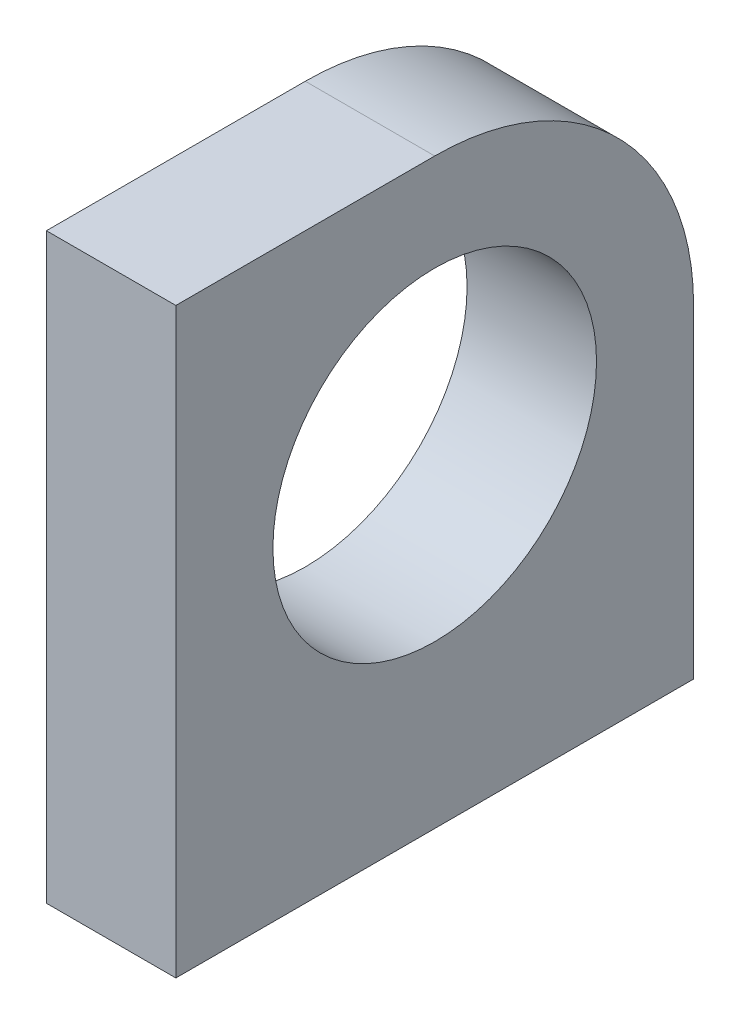
ISO-10303-21;
HEADER;
FILE_DESCRIPTION(('STEP AP214'),'2;1');
FILE_NAME('part.step','',(''),(''),'','','');
FILE_SCHEMA(('AUTOMOTIVE_DESIGN { 1 0 10303 214 1 1 1 1 }'));
ENDSEC;
DATA;
#1=APPLICATION_CONTEXT('core data for automotive mechanical design processes');
#2=APPLICATION_PROTOCOL_DEFINITION('international standard','automotive_design',2000,#1);
#3=PRODUCT_CONTEXT('',#1,'mechanical');
#4=PRODUCT('Part','Part','',(#3));
#5=PRODUCT_RELATED_PRODUCT_CATEGORY('part','',(#4));
#6=PRODUCT_DEFINITION_FORMATION('','',#4);
#7=PRODUCT_DEFINITION_CONTEXT('part definition',#1,'design');
#8=PRODUCT_DEFINITION('design','',#6,#7);
#9=PRODUCT_DEFINITION_SHAPE('','',#8);
#10=(LENGTH_UNIT() NAMED_UNIT(*) SI_UNIT(.MILLI.,.METRE.));
#11=(NAMED_UNIT(*) PLANE_ANGLE_UNIT() SI_UNIT($,.RADIAN.));
#12=(NAMED_UNIT(*) SI_UNIT($,.STERADIAN.) SOLID_ANGLE_UNIT());
#13=UNCERTAINTY_MEASURE_WITH_UNIT(LENGTH_MEASURE(1.E-05),#10,'distance_accuracy_value','');
#14=(GEOMETRIC_REPRESENTATION_CONTEXT(3) GLOBAL_UNCERTAINTY_ASSIGNED_CONTEXT((#13)) GLOBAL_UNIT_ASSIGNED_CONTEXT((#10,
#11,#12)) REPRESENTATION_CONTEXT('',''));
#15=CARTESIAN_POINT('',(0.,0.,0.));
#16=DIRECTION('',(0.,0.,1.));
#17=DIRECTION('',(1.,0.,0.));
#18=AXIS2_PLACEMENT_3D('',#15,#16,#17);
#19=CARTESIAN_POINT('',(6.35,28.575,-25.4));
#20=DIRECTION('',(0.,0.,1.));
#21=DIRECTION('',(0.,-1.,0.));
#22=AXIS2_PLACEMENT_3D('',#19,#20,#21);
#23=PLANE('',#22);
#24=DIRECTION('',(0.,1.,0.));
#25=VECTOR('',#24,1.);
#26=CARTESIAN_POINT('',(-6.35,28.575,-25.4));
#27=LINE('',#26,#25);
#28=CARTESIAN_POINT('',(-6.35,-28.575,-25.4));
#29=VERTEX_POINT('',#28);
#30=CARTESIAN_POINT('',(-6.35,3.17500000000001,-25.4));
#31=VERTEX_POINT('',#30);
#32=EDGE_CURVE('E109',#29,#31,#27,.T.);
#33=ORIENTED_EDGE('',*,*,#32,.T.);
#34=DIRECTION('',(-1.,0.,0.));
#35=VECTOR('',#34,1.);
#36=CARTESIAN_POINT('',(6.35,3.175,-25.4));
#37=LINE('',#36,#35);
#38=CARTESIAN_POINT('',(6.35,3.17500000000001,-25.4));
#39=VERTEX_POINT('',#38);
#40=EDGE_CURVE('E41',#31,#39,#37,.F.);
#41=ORIENTED_EDGE('',*,*,#40,.T.);
#42=DIRECTION('',(0.,1.,0.));
#43=VECTOR('',#42,1.);
#44=CARTESIAN_POINT('',(6.35,28.575,-25.4));
#45=LINE('',#44,#43);
#46=CARTESIAN_POINT('',(6.35,-28.575,-25.4));
#47=VERTEX_POINT('',#46);
#48=EDGE_CURVE('E89',#47,#39,#45,.T.);
#49=ORIENTED_EDGE('',*,*,#48,.F.);
#50=DIRECTION('',(-1.,0.,0.));
#51=VECTOR('',#50,1.);
#52=CARTESIAN_POINT('',(6.35,-28.575,-25.4));
#53=LINE('',#52,#51);
#54=EDGE_CURVE('E105',#47,#29,#53,.T.);
#55=ORIENTED_EDGE('',*,*,#54,.T.);
#56=EDGE_LOOP('',(#33,#41,#49,#55));
#57=FACE_BOUND('',#56,.T.);
#58=ADVANCED_FACE('F33',(#57),#23,.F.);
#59=CARTESIAN_POINT('',(6.35,28.575,25.4));
#60=DIRECTION('',(0.,-1.,0.));
#61=DIRECTION('',(0.,0.,-1.));
#62=AXIS2_PLACEMENT_3D('',#59,#60,#61);
#63=PLANE('',#62);
#64=DIRECTION('',(0.,0.,1.));
#65=VECTOR('',#64,1.);
#66=CARTESIAN_POINT('',(6.35,28.575,25.4));
#67=LINE('',#66,#65);
#68=CARTESIAN_POINT('',(6.35,28.575,0.));
#69=VERTEX_POINT('',#68);
#70=CARTESIAN_POINT('',(6.35,28.575,25.4));
#71=VERTEX_POINT('',#70);
#72=EDGE_CURVE('E79',#69,#71,#67,.T.);
#73=ORIENTED_EDGE('',*,*,#72,.F.);
#74=DIRECTION('',(-1.,0.,0.));
#75=VECTOR('',#74,1.);
#76=CARTESIAN_POINT('',(6.35,28.575,0.));
#77=LINE('',#76,#75);
#78=CARTESIAN_POINT('',(-6.35,28.575,0.));
#79=VERTEX_POINT('',#78);
#80=EDGE_CURVE('E97',#69,#79,#77,.T.);
#81=ORIENTED_EDGE('',*,*,#80,.T.);
#82=DIRECTION('',(0.,0.,1.));
#83=VECTOR('',#82,1.);
#84=CARTESIAN_POINT('',(-6.35,28.575,25.4));
#85=LINE('',#84,#83);
#86=CARTESIAN_POINT('',(-6.35,28.575,25.4));
#87=VERTEX_POINT('',#86);
#88=EDGE_CURVE('E94',#79,#87,#85,.T.);
#89=ORIENTED_EDGE('',*,*,#88,.T.);
#90=DIRECTION('',(-1.,0.,0.));
#91=VECTOR('',#90,1.);
#92=CARTESIAN_POINT('',(6.35,28.575,25.4));
#93=LINE('',#92,#91);
#94=EDGE_CURVE('E92',#71,#87,#93,.T.);
#95=ORIENTED_EDGE('',*,*,#94,.F.);
#96=EDGE_LOOP('',(#73,#81,#89,#95));
#97=FACE_BOUND('',#96,.T.);
#98=ADVANCED_FACE('F93',(#97),#63,.F.);
#99=CARTESIAN_POINT('',(6.35,28.575,25.4));
#100=DIRECTION('',(0.,0.,-1.));
#101=DIRECTION('',(0.,1.,0.));
#102=AXIS2_PLACEMENT_3D('',#99,#100,#101);
#103=PLANE('',#102);
#104=DIRECTION('',(0.,-1.,0.));
#105=VECTOR('',#104,1.);
#106=CARTESIAN_POINT('',(-6.35,28.575,25.4));
#107=LINE('',#106,#105);
#108=CARTESIAN_POINT('',(-6.35,-28.575,25.4));
#109=VERTEX_POINT('',#108);
#110=EDGE_CURVE('E113',#87,#109,#107,.T.);
#111=ORIENTED_EDGE('',*,*,#110,.T.);
#112=DIRECTION('',(-1.,0.,0.));
#113=VECTOR('',#112,1.);
#114=CARTESIAN_POINT('',(6.35,-28.575,25.4));
#115=LINE('',#114,#113);
#116=CARTESIAN_POINT('',(6.35,-28.575,25.4));
#117=VERTEX_POINT('',#116);
#118=EDGE_CURVE('E98',#117,#109,#115,.T.);
#119=ORIENTED_EDGE('',*,*,#118,.F.);
#120=DIRECTION('',(0.,-1.,0.));
#121=VECTOR('',#120,1.);
#122=CARTESIAN_POINT('',(6.35,28.575,25.4));
#123=LINE('',#122,#121);
#124=EDGE_CURVE('E83',#71,#117,#123,.T.);
#125=ORIENTED_EDGE('',*,*,#124,.F.);
#126=ORIENTED_EDGE('',*,*,#94,.T.);
#127=EDGE_LOOP('',(#111,#119,#125,#126));
#128=FACE_BOUND('',#127,.T.);
#129=ADVANCED_FACE('F100',(#128),#103,.F.);
#130=CARTESIAN_POINT('',(6.35,-28.575,25.4));
#131=DIRECTION('',(0.,1.,0.));
#132=DIRECTION('',(0.,0.,1.));
#133=AXIS2_PLACEMENT_3D('',#130,#131,#132);
#134=PLANE('',#133);
#135=DIRECTION('',(0.,0.,-1.));
#136=VECTOR('',#135,1.);
#137=CARTESIAN_POINT('',(-6.35,-28.575,25.4));
#138=LINE('',#137,#136);
#139=EDGE_CURVE('E115',#109,#29,#138,.T.);
#140=ORIENTED_EDGE('',*,*,#139,.T.);
#141=ORIENTED_EDGE('',*,*,#54,.F.);
#142=DIRECTION('',(0.,0.,-1.));
#143=VECTOR('',#142,1.);
#144=CARTESIAN_POINT('',(6.35,-28.575,25.4));
#145=LINE('',#144,#143);
#146=EDGE_CURVE('E103',#117,#47,#145,.T.);
#147=ORIENTED_EDGE('',*,*,#146,.F.);
#148=ORIENTED_EDGE('',*,*,#118,.T.);
#149=EDGE_LOOP('',(#140,#141,#147,#148));
#150=FACE_BOUND('',#149,.T.);
#151=ADVANCED_FACE('F125',(#150),#134,.F.);
#152=CARTESIAN_POINT('',(6.35,0.,0.));
#153=DIRECTION('',(1.,0.,0.));
#154=DIRECTION('',(0.,0.,-1.));
#155=AXIS2_PLACEMENT_3D('',#152,#153,#154);
#156=PLANE('',#155);
#157=CARTESIAN_POINT('',(6.35,3.175,0.));
#158=DIRECTION('',(1.,0.,0.));
#159=DIRECTION('',(0.,0.,-1.));
#160=AXIS2_PLACEMENT_3D('',#157,#158,#159);
#161=CIRCLE('',#160,15.875);
#162=CARTESIAN_POINT('',(6.35,3.175,-15.875));
#163=VERTEX_POINT('',#162);
#164=EDGE_CURVE('E153',#163,#163,#161,.T.);
#165=ORIENTED_EDGE('',*,*,#164,.F.);
#166=EDGE_LOOP('',(#165));
#167=FACE_BOUND('',#166,.T.);
#168=ORIENTED_EDGE('',*,*,#48,.T.);
#169=CARTESIAN_POINT('',(6.35,3.175,0.));
#170=DIRECTION('',(1.,0.,0.));
#171=DIRECTION('',(0.,0.,-1.));
#172=AXIS2_PLACEMENT_3D('',#169,#170,#171);
#173=CIRCLE('',#172,25.4);
#174=EDGE_CURVE('E11',#39,#69,#173,.T.);
#175=ORIENTED_EDGE('',*,*,#174,.T.);
#176=ORIENTED_EDGE('',*,*,#72,.T.);
#177=ORIENTED_EDGE('',*,*,#124,.T.);
#178=ORIENTED_EDGE('',*,*,#146,.T.);
#179=EDGE_LOOP('',(#168,#175,#176,#177,#178));
#180=FACE_BOUND('',#179,.T.);
#181=ADVANCED_FACE('F81',(#167,#180),#156,.T.);
#182=CARTESIAN_POINT('',(-6.35,0.,0.));
#183=DIRECTION('',(1.,0.,0.));
#184=DIRECTION('',(0.,0.,-1.));
#185=AXIS2_PLACEMENT_3D('',#182,#183,#184);
#186=PLANE('',#185);
#187=CARTESIAN_POINT('',(-6.35,3.175,0.));
#188=DIRECTION('',(1.,0.,0.));
#189=DIRECTION('',(0.,0.,-1.));
#190=AXIS2_PLACEMENT_3D('',#187,#188,#189);
#191=CIRCLE('',#190,15.875);
#192=CARTESIAN_POINT('',(-6.35,3.175,-15.875));
#193=VERTEX_POINT('',#192);
#194=EDGE_CURVE('E111',#193,#193,#191,.F.);
#195=ORIENTED_EDGE('',*,*,#194,.F.);
#196=EDGE_LOOP('',(#195));
#197=FACE_BOUND('',#196,.T.);
#198=ORIENTED_EDGE('',*,*,#88,.F.);
#199=CARTESIAN_POINT('',(-6.35,3.175,0.));
#200=DIRECTION('',(1.,0.,0.));
#201=DIRECTION('',(0.,0.,-1.));
#202=AXIS2_PLACEMENT_3D('',#199,#200,#201);
#203=CIRCLE('',#202,25.4);
#204=EDGE_CURVE('E55',#79,#31,#203,.F.);
#205=ORIENTED_EDGE('',*,*,#204,.T.);
#206=ORIENTED_EDGE('',*,*,#32,.F.);
#207=ORIENTED_EDGE('',*,*,#139,.F.);
#208=ORIENTED_EDGE('',*,*,#110,.F.);
#209=EDGE_LOOP('',(#198,#205,#206,#207,#208));
#210=FACE_BOUND('',#209,.T.);
#211=ADVANCED_FACE('F122',(#197,#210),#186,.F.);
#212=CARTESIAN_POINT('',(-6.351,3.175,0.));
#213=DIRECTION('',(1.,0.,0.));
#214=DIRECTION('',(0.,0.,-1.));
#215=AXIS2_PLACEMENT_3D('',#212,#213,#214);
#216=CYLINDRICAL_SURFACE('',#215,15.875);
#217=ORIENTED_EDGE('',*,*,#164,.T.);
#218=EDGE_LOOP('',(#217));
#219=FACE_BOUND('',#218,.T.);
#220=ORIENTED_EDGE('',*,*,#194,.T.);
#221=EDGE_LOOP('',(#220));
#222=FACE_BOUND('',#221,.T.);
#223=ADVANCED_FACE('F128',(#219,#222),#216,.F.);
#224=CARTESIAN_POINT('',(6.35,3.175,0.));
#225=DIRECTION('',(-1.,0.,0.));
#226=DIRECTION('',(0.,0.,1.));
#227=AXIS2_PLACEMENT_3D('',#224,#225,#226);
#228=CYLINDRICAL_SURFACE('',#227,25.4);
#229=ORIENTED_EDGE('',*,*,#174,.F.);
#230=ORIENTED_EDGE('',*,*,#40,.F.);
#231=ORIENTED_EDGE('',*,*,#204,.F.);
#232=ORIENTED_EDGE('',*,*,#80,.F.);
#233=EDGE_LOOP('',(#229,#230,#231,#232));
#234=FACE_BOUND('',#233,.T.);
#235=ADVANCED_FACE('F35',(#234),#228,.T.);
#236=CLOSED_SHELL('',(#58,#98,#129,#151,#181,#211,#223,#235));
#237=MANIFOLD_SOLID_BREP('B2',#236);
#238=ADVANCED_BREP_SHAPE_REPRESENTATION('',(#18,#237),#14);
#239=SHAPE_DEFINITION_REPRESENTATION(#9,#238);
ENDSEC;
END-ISO-10303-21;
